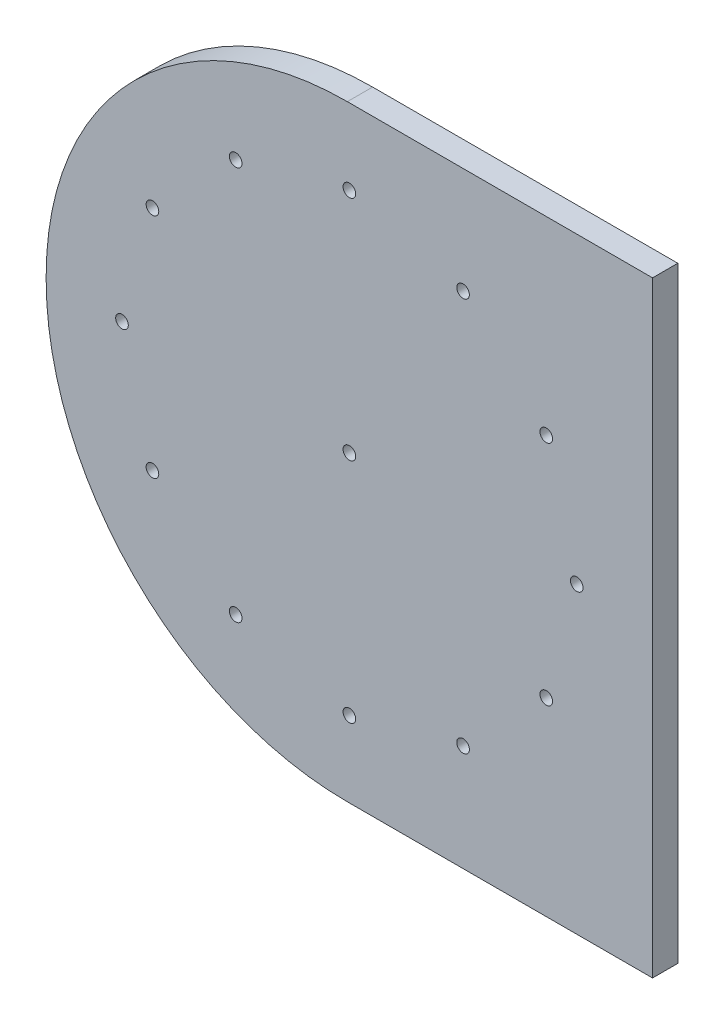
ISO-10303-21;
HEADER;
FILE_DESCRIPTION(('STEP AP214'),'2;1');
FILE_NAME('part.step','',(''),(''),'','','');
FILE_SCHEMA(('AUTOMOTIVE_DESIGN { 1 0 10303 214 1 1 1 1 }'));
ENDSEC;
DATA;
#1=APPLICATION_CONTEXT('core data for automotive mechanical design processes');
#2=APPLICATION_PROTOCOL_DEFINITION('international standard','automotive_design',2000,#1);
#3=PRODUCT_CONTEXT('',#1,'mechanical');
#4=PRODUCT('Part','Part','',(#3));
#5=PRODUCT_RELATED_PRODUCT_CATEGORY('part','',(#4));
#6=PRODUCT_DEFINITION_FORMATION('','',#4);
#7=PRODUCT_DEFINITION_CONTEXT('part definition',#1,'design');
#8=PRODUCT_DEFINITION('design','',#6,#7);
#9=PRODUCT_DEFINITION_SHAPE('','',#8);
#10=(LENGTH_UNIT() NAMED_UNIT(*) SI_UNIT(.MILLI.,.METRE.));
#11=(NAMED_UNIT(*) PLANE_ANGLE_UNIT() SI_UNIT($,.RADIAN.));
#12=(NAMED_UNIT(*) SI_UNIT($,.STERADIAN.) SOLID_ANGLE_UNIT());
#13=UNCERTAINTY_MEASURE_WITH_UNIT(LENGTH_MEASURE(1.E-05),#10,'distance_accuracy_value','');
#14=(GEOMETRIC_REPRESENTATION_CONTEXT(3) GLOBAL_UNCERTAINTY_ASSIGNED_CONTEXT((#13)) GLOBAL_UNIT_ASSIGNED_CONTEXT((#10,
#11,#12)) REPRESENTATION_CONTEXT('',''));
#15=CARTESIAN_POINT('',(0.,0.,0.));
#16=DIRECTION('',(0.,0.,1.));
#17=DIRECTION('',(1.,0.,0.));
#18=AXIS2_PLACEMENT_3D('',#15,#16,#17);
#19=CARTESIAN_POINT('',(37.846,-38.354,3.175));
#20=DIRECTION('',(0.,0.,1.));
#21=DIRECTION('',(1.,0.,0.));
#22=AXIS2_PLACEMENT_3D('',#19,#20,#21);
#23=PLANE('',#22);
#24=CARTESIAN_POINT('',(52.3875000000003,-13.3533240868598,3.175));
#25=DIRECTION('',(0.,0.,1.));
#26=DIRECTION('',(1.,0.,0.));
#27=AXIS2_PLACEMENT_3D('',#24,#25,#26);
#28=CIRCLE('',#27,0.793749999999998);
#29=CARTESIAN_POINT('',(53.1812500000003,-13.3533240868598,3.175));
#30=VERTEX_POINT('',#29);
#31=EDGE_CURVE('E228',#30,#30,#28,.F.);
#32=ORIENTED_EDGE('',*,*,#31,.T.);
#33=EDGE_LOOP('',(#32));
#34=FACE_BOUND('',#33,.T.);
#35=CARTESIAN_POINT('',(23.8125000000002,-13.3533240868595,3.175));
#36=DIRECTION('',(0.,0.,1.));
#37=DIRECTION('',(1.,0.,0.));
#38=AXIS2_PLACEMENT_3D('',#35,#36,#37);
#39=CIRCLE('',#38,0.793749999999999);
#40=CARTESIAN_POINT('',(24.6062500000002,-13.3533240868595,3.175));
#41=VERTEX_POINT('',#40);
#42=EDGE_CURVE('E239',#41,#41,#39,.F.);
#43=ORIENTED_EDGE('',*,*,#42,.T.);
#44=EDGE_LOOP('',(#43));
#45=FACE_BOUND('',#44,.T.);
#46=CARTESIAN_POINT('',(9.52500000000002,-38.0999999999994,3.175));
#47=DIRECTION('',(0.,0.,1.));
#48=DIRECTION('',(1.,0.,0.));
#49=AXIS2_PLACEMENT_3D('',#46,#47,#48);
#50=CIRCLE('',#49,0.79375);
#51=CARTESIAN_POINT('',(10.31875,-38.0999999999994,3.175));
#52=VERTEX_POINT('',#51);
#53=EDGE_CURVE('E251',#52,#52,#50,.F.);
#54=ORIENTED_EDGE('',*,*,#53,.T.);
#55=EDGE_LOOP('',(#54));
#56=FACE_BOUND('',#55,.T.);
#57=CARTESIAN_POINT('',(23.8124999999995,-62.8466759131401,3.175));
#58=DIRECTION('',(0.,0.,1.));
#59=DIRECTION('',(1.,0.,0.));
#60=AXIS2_PLACEMENT_3D('',#57,#58,#59);
#61=CIRCLE('',#60,0.793750000000006);
#62=CARTESIAN_POINT('',(24.6062499999995,-62.8466759131401,3.175));
#63=VERTEX_POINT('',#62);
#64=EDGE_CURVE('E263',#63,#63,#61,.F.);
#65=ORIENTED_EDGE('',*,*,#64,.T.);
#66=EDGE_LOOP('',(#65));
#67=FACE_BOUND('',#66,.T.);
#68=CARTESIAN_POINT('',(52.3874999999996,-62.8466759131406,3.175));
#69=DIRECTION('',(0.,0.,1.));
#70=DIRECTION('',(1.,0.,0.));
#71=AXIS2_PLACEMENT_3D('',#68,#69,#70);
#72=CIRCLE('',#71,0.793749999999992);
#73=CARTESIAN_POINT('',(53.1812499999996,-62.8466759131406,3.175));
#74=VERTEX_POINT('',#73);
#75=EDGE_CURVE('E275',#74,#74,#72,.F.);
#76=ORIENTED_EDGE('',*,*,#75,.T.);
#77=EDGE_LOOP('',(#76));
#78=FACE_BOUND('',#77,.T.);
#79=CARTESIAN_POINT('',(66.675,-38.1,3.175));
#80=DIRECTION('',(0.,0.,1.));
#81=DIRECTION('',(1.,0.,0.));
#82=AXIS2_PLACEMENT_3D('',#79,#80,#81);
#83=CIRCLE('',#82,0.793749999999993);
#84=CARTESIAN_POINT('',(67.46875,-38.1,3.175));
#85=VERTEX_POINT('',#84);
#86=EDGE_CURVE('E287',#85,#85,#83,.F.);
#87=ORIENTED_EDGE('',*,*,#86,.T.);
#88=EDGE_LOOP('',(#87));
#89=FACE_BOUND('',#88,.T.);
#90=CARTESIAN_POINT('',(37.846,-38.354,3.175));
#91=DIRECTION('',(0.,0.,1.));
#92=DIRECTION('',(1.,0.,0.));
#93=AXIS2_PLACEMENT_3D('',#90,#91,#92);
#94=CIRCLE('',#93,37.846);
#95=CARTESIAN_POINT('',(0.,-38.354,3.175));
#96=VERTEX_POINT('',#95);
#97=CARTESIAN_POINT('',(37.846,-76.2,3.175));
#98=VERTEX_POINT('',#97);
#99=EDGE_CURVE('E129',#96,#98,#94,.T.);
#100=ORIENTED_EDGE('',*,*,#99,.T.);
#101=DIRECTION('',(1.,0.,0.));
#102=VECTOR('',#101,1.);
#103=CARTESIAN_POINT('',(37.846,-76.2,3.175));
#104=LINE('',#103,#102);
#105=CARTESIAN_POINT('',(76.2,-76.2,3.175));
#106=VERTEX_POINT('',#105);
#107=EDGE_CURVE('E87',#98,#106,#104,.T.);
#108=ORIENTED_EDGE('',*,*,#107,.T.);
#109=DIRECTION('',(0.,1.,0.));
#110=VECTOR('',#109,1.);
#111=CARTESIAN_POINT('',(76.2,0.,3.175));
#112=LINE('',#111,#110);
#113=CARTESIAN_POINT('',(76.2,0.,3.175));
#114=VERTEX_POINT('',#113);
#115=EDGE_CURVE('E100',#106,#114,#112,.T.);
#116=ORIENTED_EDGE('',*,*,#115,.T.);
#117=DIRECTION('',(-1.,0.,0.));
#118=VECTOR('',#117,1.);
#119=CARTESIAN_POINT('',(37.846,0.,3.175));
#120=LINE('',#119,#118);
#121=CARTESIAN_POINT('',(37.846,0.,3.175));
#122=VERTEX_POINT('',#121);
#123=EDGE_CURVE('E94',#114,#122,#120,.T.);
#124=ORIENTED_EDGE('',*,*,#123,.T.);
#125=CARTESIAN_POINT('',(37.846,-37.846,3.175));
#126=DIRECTION('',(0.,0.,1.));
#127=DIRECTION('',(-1.,0.,0.));
#128=AXIS2_PLACEMENT_3D('',#125,#126,#127);
#129=CIRCLE('',#128,37.846);
#130=CARTESIAN_POINT('',(0.,-37.846,3.175));
#131=VERTEX_POINT('',#130);
#132=EDGE_CURVE('E98',#122,#131,#129,.T.);
#133=ORIENTED_EDGE('',*,*,#132,.T.);
#134=DIRECTION('',(0.,-1.,0.));
#135=VECTOR('',#134,1.);
#136=CARTESIAN_POINT('',(0.,-37.846,3.175));
#137=LINE('',#136,#135);
#138=EDGE_CURVE('E50',#131,#96,#137,.T.);
#139=ORIENTED_EDGE('',*,*,#138,.T.);
#140=EDGE_LOOP('',(#100,#108,#116,#124,#133,#139));
#141=FACE_BOUND('',#140,.T.);
#142=CARTESIAN_POINT('',(38.1,-38.1,3.175));
#143=DIRECTION('',(0.,0.,1.));
#144=DIRECTION('',(1.,0.,0.));
#145=AXIS2_PLACEMENT_3D('',#142,#143,#144);
#146=CIRCLE('',#145,0.793749999999999);
#147=CARTESIAN_POINT('',(38.89375,-38.1,3.175));
#148=VERTEX_POINT('',#147);
#149=EDGE_CURVE('E122',#148,#148,#146,.F.);
#150=ORIENTED_EDGE('',*,*,#149,.T.);
#151=EDGE_LOOP('',(#150));
#152=FACE_BOUND('',#151,.T.);
#153=CARTESIAN_POINT('',(62.8466759131401,-52.3875000000004,3.175));
#154=DIRECTION('',(0.,0.,1.));
#155=DIRECTION('',(1.,0.,0.));
#156=AXIS2_PLACEMENT_3D('',#153,#154,#155);
#157=CIRCLE('',#156,0.793749999999985);
#158=CARTESIAN_POINT('',(63.6404259131401,-52.3875000000004,3.175));
#159=VERTEX_POINT('',#158);
#160=EDGE_CURVE('E281',#159,#159,#157,.F.);
#161=ORIENTED_EDGE('',*,*,#160,.T.);
#162=EDGE_LOOP('',(#161));
#163=FACE_BOUND('',#162,.T.);
#164=CARTESIAN_POINT('',(38.0999999999995,-66.675,3.175));
#165=DIRECTION('',(0.,0.,1.));
#166=DIRECTION('',(1.,0.,0.));
#167=AXIS2_PLACEMENT_3D('',#164,#165,#166);
#168=CIRCLE('',#167,0.793750000000002);
#169=CARTESIAN_POINT('',(38.8937499999995,-66.675,3.175));
#170=VERTEX_POINT('',#169);
#171=EDGE_CURVE('E269',#170,#170,#168,.F.);
#172=ORIENTED_EDGE('',*,*,#171,.T.);
#173=EDGE_LOOP('',(#172));
#174=FACE_BOUND('',#173,.T.);
#175=CARTESIAN_POINT('',(13.3533240868594,-52.3874999999995,3.175));
#176=DIRECTION('',(0.,0.,1.));
#177=DIRECTION('',(1.,0.,0.));
#178=AXIS2_PLACEMENT_3D('',#175,#176,#177);
#179=CIRCLE('',#178,0.79375);
#180=CARTESIAN_POINT('',(14.1470740868594,-52.3874999999995,3.175));
#181=VERTEX_POINT('',#180);
#182=EDGE_CURVE('E257',#181,#181,#179,.F.);
#183=ORIENTED_EDGE('',*,*,#182,.T.);
#184=EDGE_LOOP('',(#183));
#185=FACE_BOUND('',#184,.T.);
#186=CARTESIAN_POINT('',(13.35332408686,-23.8124999999995,3.175));
#187=DIRECTION('',(0.,0.,1.));
#188=DIRECTION('',(1.,0.,0.));
#189=AXIS2_PLACEMENT_3D('',#186,#187,#188);
#190=CIRCLE('',#189,0.793750000000001);
#191=CARTESIAN_POINT('',(14.14707408686,-23.8124999999995,3.175));
#192=VERTEX_POINT('',#191);
#193=EDGE_CURVE('E245',#192,#192,#190,.F.);
#194=ORIENTED_EDGE('',*,*,#193,.T.);
#195=EDGE_LOOP('',(#194));
#196=FACE_BOUND('',#195,.T.);
#197=CARTESIAN_POINT('',(38.1000000000003,-9.52500000000001,3.175));
#198=DIRECTION('',(0.,0.,1.));
#199=DIRECTION('',(1.,0.,0.));
#200=AXIS2_PLACEMENT_3D('',#197,#198,#199);
#201=CIRCLE('',#200,0.793749999999999);
#202=CARTESIAN_POINT('',(38.8937500000003,-9.52500000000001,3.175));
#203=VERTEX_POINT('',#202);
#204=EDGE_CURVE('E233',#203,#203,#201,.F.);
#205=ORIENTED_EDGE('',*,*,#204,.T.);
#206=EDGE_LOOP('',(#205));
#207=FACE_BOUND('',#206,.T.);
#208=CARTESIAN_POINT('',(62.8466759131405,-23.8125000000004,3.175));
#209=DIRECTION('',(0.,0.,1.));
#210=DIRECTION('',(1.,0.,0.));
#211=AXIS2_PLACEMENT_3D('',#208,#209,#210);
#212=CIRCLE('',#211,0.793749999999993);
#213=CARTESIAN_POINT('',(63.6404259131405,-23.8125000000004,3.175));
#214=VERTEX_POINT('',#213);
#215=EDGE_CURVE('E217',#214,#214,#212,.F.);
#216=ORIENTED_EDGE('',*,*,#215,.T.);
#217=EDGE_LOOP('',(#216));
#218=FACE_BOUND('',#217,.T.);
#219=ADVANCED_FACE('F33',(#34,#45,#56,#67,#78,#89,#141,#152,#163,#174,#185,#196,#207,#218),#23,.T.);
#220=CARTESIAN_POINT('',(37.846,-38.354,0.));
#221=DIRECTION('',(0.,0.,1.));
#222=DIRECTION('',(1.,0.,0.));
#223=AXIS2_PLACEMENT_3D('',#220,#221,#222);
#224=PLANE('',#223);
#225=CARTESIAN_POINT('',(52.3875000000003,-13.3533240868598,0.));
#226=DIRECTION('',(0.,0.,1.));
#227=DIRECTION('',(1.,0.,0.));
#228=AXIS2_PLACEMENT_3D('',#225,#226,#227);
#229=CIRCLE('',#228,0.793749999999998);
#230=CARTESIAN_POINT('',(53.1812500000003,-13.3533240868598,0.));
#231=VERTEX_POINT('',#230);
#232=EDGE_CURVE('E223',#231,#231,#229,.T.);
#233=ORIENTED_EDGE('',*,*,#232,.T.);
#234=EDGE_LOOP('',(#233));
#235=FACE_BOUND('',#234,.T.);
#236=CARTESIAN_POINT('',(23.8125000000002,-13.3533240868595,0.));
#237=DIRECTION('',(0.,0.,1.));
#238=DIRECTION('',(1.,0.,0.));
#239=AXIS2_PLACEMENT_3D('',#236,#237,#238);
#240=CIRCLE('',#239,0.793749999999999);
#241=CARTESIAN_POINT('',(24.6062500000002,-13.3533240868595,0.));
#242=VERTEX_POINT('',#241);
#243=EDGE_CURVE('E236',#242,#242,#240,.T.);
#244=ORIENTED_EDGE('',*,*,#243,.T.);
#245=EDGE_LOOP('',(#244));
#246=FACE_BOUND('',#245,.T.);
#247=CARTESIAN_POINT('',(9.52500000000002,-38.0999999999994,0.));
#248=DIRECTION('',(0.,0.,1.));
#249=DIRECTION('',(1.,0.,0.));
#250=AXIS2_PLACEMENT_3D('',#247,#248,#249);
#251=CIRCLE('',#250,0.79375);
#252=CARTESIAN_POINT('',(10.31875,-38.0999999999994,0.));
#253=VERTEX_POINT('',#252);
#254=EDGE_CURVE('E248',#253,#253,#251,.T.);
#255=ORIENTED_EDGE('',*,*,#254,.T.);
#256=EDGE_LOOP('',(#255));
#257=FACE_BOUND('',#256,.T.);
#258=CARTESIAN_POINT('',(23.8124999999995,-62.8466759131401,0.));
#259=DIRECTION('',(0.,0.,1.));
#260=DIRECTION('',(1.,0.,0.));
#261=AXIS2_PLACEMENT_3D('',#258,#259,#260);
#262=CIRCLE('',#261,0.793750000000006);
#263=CARTESIAN_POINT('',(24.6062499999995,-62.8466759131401,0.));
#264=VERTEX_POINT('',#263);
#265=EDGE_CURVE('E260',#264,#264,#262,.T.);
#266=ORIENTED_EDGE('',*,*,#265,.T.);
#267=EDGE_LOOP('',(#266));
#268=FACE_BOUND('',#267,.T.);
#269=CARTESIAN_POINT('',(52.3874999999996,-62.8466759131406,0.));
#270=DIRECTION('',(0.,0.,1.));
#271=DIRECTION('',(1.,0.,0.));
#272=AXIS2_PLACEMENT_3D('',#269,#270,#271);
#273=CIRCLE('',#272,0.793749999999992);
#274=CARTESIAN_POINT('',(53.1812499999996,-62.8466759131406,0.));
#275=VERTEX_POINT('',#274);
#276=EDGE_CURVE('E272',#275,#275,#273,.T.);
#277=ORIENTED_EDGE('',*,*,#276,.T.);
#278=EDGE_LOOP('',(#277));
#279=FACE_BOUND('',#278,.T.);
#280=CARTESIAN_POINT('',(66.675,-38.1,0.));
#281=DIRECTION('',(0.,0.,1.));
#282=DIRECTION('',(1.,0.,0.));
#283=AXIS2_PLACEMENT_3D('',#280,#281,#282);
#284=CIRCLE('',#283,0.793749999999993);
#285=CARTESIAN_POINT('',(67.46875,-38.1,0.));
#286=VERTEX_POINT('',#285);
#287=EDGE_CURVE('E284',#286,#286,#284,.T.);
#288=ORIENTED_EDGE('',*,*,#287,.T.);
#289=EDGE_LOOP('',(#288));
#290=FACE_BOUND('',#289,.T.);
#291=CARTESIAN_POINT('',(37.846,-38.354,0.));
#292=DIRECTION('',(0.,0.,1.));
#293=DIRECTION('',(1.,0.,0.));
#294=AXIS2_PLACEMENT_3D('',#291,#292,#293);
#295=CIRCLE('',#294,37.846);
#296=CARTESIAN_POINT('',(0.,-38.354,0.));
#297=VERTEX_POINT('',#296);
#298=CARTESIAN_POINT('',(37.846,-76.2,0.));
#299=VERTEX_POINT('',#298);
#300=EDGE_CURVE('E118',#297,#299,#295,.T.);
#301=ORIENTED_EDGE('',*,*,#300,.F.);
#302=DIRECTION('',(0.,-1.,0.));
#303=VECTOR('',#302,1.);
#304=CARTESIAN_POINT('',(0.,-37.846,0.));
#305=LINE('',#304,#303);
#306=CARTESIAN_POINT('',(0.,-37.846,0.));
#307=VERTEX_POINT('',#306);
#308=EDGE_CURVE('E79',#307,#297,#305,.T.);
#309=ORIENTED_EDGE('',*,*,#308,.F.);
#310=CARTESIAN_POINT('',(37.846,-37.846,0.));
#311=DIRECTION('',(0.,0.,1.));
#312=DIRECTION('',(-1.,0.,0.));
#313=AXIS2_PLACEMENT_3D('',#310,#311,#312);
#314=CIRCLE('',#313,37.846);
#315=CARTESIAN_POINT('',(37.846,0.,0.));
#316=VERTEX_POINT('',#315);
#317=EDGE_CURVE('E73',#316,#307,#314,.T.);
#318=ORIENTED_EDGE('',*,*,#317,.F.);
#319=DIRECTION('',(-1.,0.,0.));
#320=VECTOR('',#319,1.);
#321=CARTESIAN_POINT('',(37.846,0.,0.));
#322=LINE('',#321,#320);
#323=CARTESIAN_POINT('',(76.2,0.,0.));
#324=VERTEX_POINT('',#323);
#325=EDGE_CURVE('E108',#324,#316,#322,.T.);
#326=ORIENTED_EDGE('',*,*,#325,.F.);
#327=DIRECTION('',(0.,1.,0.));
#328=VECTOR('',#327,1.);
#329=CARTESIAN_POINT('',(76.2,0.,0.));
#330=LINE('',#329,#328);
#331=CARTESIAN_POINT('',(76.2,-76.2,0.));
#332=VERTEX_POINT('',#331);
#333=EDGE_CURVE('E124',#332,#324,#330,.T.);
#334=ORIENTED_EDGE('',*,*,#333,.F.);
#335=DIRECTION('',(1.,0.,0.));
#336=VECTOR('',#335,1.);
#337=CARTESIAN_POINT('',(37.846,-76.2,0.));
#338=LINE('',#337,#336);
#339=EDGE_CURVE('E121',#299,#332,#338,.T.);
#340=ORIENTED_EDGE('',*,*,#339,.F.);
#341=EDGE_LOOP('',(#301,#309,#318,#326,#334,#340));
#342=FACE_BOUND('',#341,.T.);
#343=CARTESIAN_POINT('',(38.1,-38.1,0.));
#344=DIRECTION('',(0.,0.,1.));
#345=DIRECTION('',(1.,0.,0.));
#346=AXIS2_PLACEMENT_3D('',#343,#344,#345);
#347=CIRCLE('',#346,0.793749999999999);
#348=CARTESIAN_POINT('',(38.89375,-38.1,0.));
#349=VERTEX_POINT('',#348);
#350=EDGE_CURVE('E290',#349,#349,#347,.T.);
#351=ORIENTED_EDGE('',*,*,#350,.T.);
#352=EDGE_LOOP('',(#351));
#353=FACE_BOUND('',#352,.T.);
#354=CARTESIAN_POINT('',(62.8466759131401,-52.3875000000004,0.));
#355=DIRECTION('',(0.,0.,1.));
#356=DIRECTION('',(1.,0.,0.));
#357=AXIS2_PLACEMENT_3D('',#354,#355,#356);
#358=CIRCLE('',#357,0.793749999999985);
#359=CARTESIAN_POINT('',(63.6404259131401,-52.3875000000004,0.));
#360=VERTEX_POINT('',#359);
#361=EDGE_CURVE('E278',#360,#360,#358,.T.);
#362=ORIENTED_EDGE('',*,*,#361,.T.);
#363=EDGE_LOOP('',(#362));
#364=FACE_BOUND('',#363,.T.);
#365=CARTESIAN_POINT('',(38.0999999999995,-66.675,0.));
#366=DIRECTION('',(0.,0.,1.));
#367=DIRECTION('',(1.,0.,0.));
#368=AXIS2_PLACEMENT_3D('',#365,#366,#367);
#369=CIRCLE('',#368,0.793750000000002);
#370=CARTESIAN_POINT('',(38.8937499999995,-66.675,0.));
#371=VERTEX_POINT('',#370);
#372=EDGE_CURVE('E266',#371,#371,#369,.T.);
#373=ORIENTED_EDGE('',*,*,#372,.T.);
#374=EDGE_LOOP('',(#373));
#375=FACE_BOUND('',#374,.T.);
#376=CARTESIAN_POINT('',(13.3533240868594,-52.3874999999995,0.));
#377=DIRECTION('',(0.,0.,1.));
#378=DIRECTION('',(1.,0.,0.));
#379=AXIS2_PLACEMENT_3D('',#376,#377,#378);
#380=CIRCLE('',#379,0.79375);
#381=CARTESIAN_POINT('',(14.1470740868594,-52.3874999999995,0.));
#382=VERTEX_POINT('',#381);
#383=EDGE_CURVE('E254',#382,#382,#380,.T.);
#384=ORIENTED_EDGE('',*,*,#383,.T.);
#385=EDGE_LOOP('',(#384));
#386=FACE_BOUND('',#385,.T.);
#387=CARTESIAN_POINT('',(13.35332408686,-23.8124999999995,0.));
#388=DIRECTION('',(0.,0.,1.));
#389=DIRECTION('',(1.,0.,0.));
#390=AXIS2_PLACEMENT_3D('',#387,#388,#389);
#391=CIRCLE('',#390,0.793750000000001);
#392=CARTESIAN_POINT('',(14.14707408686,-23.8124999999995,0.));
#393=VERTEX_POINT('',#392);
#394=EDGE_CURVE('E242',#393,#393,#391,.T.);
#395=ORIENTED_EDGE('',*,*,#394,.T.);
#396=EDGE_LOOP('',(#395));
#397=FACE_BOUND('',#396,.T.);
#398=CARTESIAN_POINT('',(38.1000000000003,-9.52500000000001,0.));
#399=DIRECTION('',(0.,0.,1.));
#400=DIRECTION('',(1.,0.,0.));
#401=AXIS2_PLACEMENT_3D('',#398,#399,#400);
#402=CIRCLE('',#401,0.793749999999999);
#403=CARTESIAN_POINT('',(38.8937500000003,-9.52500000000001,0.));
#404=VERTEX_POINT('',#403);
#405=EDGE_CURVE('E230',#404,#404,#402,.T.);
#406=ORIENTED_EDGE('',*,*,#405,.T.);
#407=EDGE_LOOP('',(#406));
#408=FACE_BOUND('',#407,.T.);
#409=CARTESIAN_POINT('',(62.8466759131405,-23.8125000000004,0.));
#410=DIRECTION('',(0.,0.,1.));
#411=DIRECTION('',(1.,0.,0.));
#412=AXIS2_PLACEMENT_3D('',#409,#410,#411);
#413=CIRCLE('',#412,0.793749999999993);
#414=CARTESIAN_POINT('',(63.6404259131405,-23.8125000000004,0.));
#415=VERTEX_POINT('',#414);
#416=EDGE_CURVE('E220',#415,#415,#413,.T.);
#417=ORIENTED_EDGE('',*,*,#416,.T.);
#418=EDGE_LOOP('',(#417));
#419=FACE_BOUND('',#418,.T.);
#420=ADVANCED_FACE('F138',(#235,#246,#257,#268,#279,#290,#342,#353,#364,#375,#386,#397,#408,
#419),#224,.F.);
#421=CARTESIAN_POINT('',(37.846,-38.354,3.175));
#422=DIRECTION('',(0.,0.,-1.));
#423=DIRECTION('',(-1.,0.,0.));
#424=AXIS2_PLACEMENT_3D('',#421,#422,#423);
#425=CYLINDRICAL_SURFACE('',#424,37.846);
#426=ORIENTED_EDGE('',*,*,#300,.T.);
#427=DIRECTION('',(0.,0.,-1.));
#428=VECTOR('',#427,1.);
#429=CARTESIAN_POINT('',(37.846,-76.2,3.175));
#430=LINE('',#429,#428);
#431=EDGE_CURVE('E11',#98,#299,#430,.T.);
#432=ORIENTED_EDGE('',*,*,#431,.F.);
#433=ORIENTED_EDGE('',*,*,#99,.F.);
#434=DIRECTION('',(0.,0.,-1.));
#435=VECTOR('',#434,1.);
#436=CARTESIAN_POINT('',(0.,-38.354,3.175));
#437=LINE('',#436,#435);
#438=EDGE_CURVE('E114',#96,#297,#437,.T.);
#439=ORIENTED_EDGE('',*,*,#438,.T.);
#440=EDGE_LOOP('',(#426,#432,#433,#439));
#441=FACE_BOUND('',#440,.T.);
#442=ADVANCED_FACE('F35',(#441),#425,.T.);
#443=CARTESIAN_POINT('',(37.846,-76.2,3.175));
#444=DIRECTION('',(0.,1.,0.));
#445=DIRECTION('',(-1.,0.,0.));
#446=AXIS2_PLACEMENT_3D('',#443,#444,#445);
#447=PLANE('',#446);
#448=ORIENTED_EDGE('',*,*,#339,.T.);
#449=DIRECTION('',(0.,0.,-1.));
#450=VECTOR('',#449,1.);
#451=CARTESIAN_POINT('',(76.2,-76.2,3.175));
#452=LINE('',#451,#450);
#453=EDGE_CURVE('E42',#106,#332,#452,.T.);
#454=ORIENTED_EDGE('',*,*,#453,.F.);
#455=ORIENTED_EDGE('',*,*,#107,.F.);
#456=ORIENTED_EDGE('',*,*,#431,.T.);
#457=EDGE_LOOP('',(#448,#454,#455,#456));
#458=FACE_BOUND('',#457,.T.);
#459=ADVANCED_FACE('F438',(#458),#447,.F.);
#460=CARTESIAN_POINT('',(76.2,0.,3.175));
#461=DIRECTION('',(-1.,0.,0.));
#462=DIRECTION('',(0.,-1.,0.));
#463=AXIS2_PLACEMENT_3D('',#460,#461,#462);
#464=PLANE('',#463);
#465=ORIENTED_EDGE('',*,*,#333,.T.);
#466=DIRECTION('',(0.,0.,-1.));
#467=VECTOR('',#466,1.);
#468=CARTESIAN_POINT('',(76.2,0.,3.175));
#469=LINE('',#468,#467);
#470=EDGE_CURVE('E109',#114,#324,#469,.T.);
#471=ORIENTED_EDGE('',*,*,#470,.F.);
#472=ORIENTED_EDGE('',*,*,#115,.F.);
#473=ORIENTED_EDGE('',*,*,#453,.T.);
#474=EDGE_LOOP('',(#465,#471,#472,#473));
#475=FACE_BOUND('',#474,.T.);
#476=ADVANCED_FACE('F135',(#475),#464,.F.);
#477=CARTESIAN_POINT('',(37.846,0.,3.175));
#478=DIRECTION('',(0.,-1.,0.));
#479=DIRECTION('',(0.,0.,-1.));
#480=AXIS2_PLACEMENT_3D('',#477,#478,#479);
#481=PLANE('',#480);
#482=ORIENTED_EDGE('',*,*,#325,.T.);
#483=DIRECTION('',(0.,0.,-1.));
#484=VECTOR('',#483,1.);
#485=CARTESIAN_POINT('',(37.846,0.,3.175));
#486=LINE('',#485,#484);
#487=EDGE_CURVE('E105',#122,#316,#486,.T.);
#488=ORIENTED_EDGE('',*,*,#487,.F.);
#489=ORIENTED_EDGE('',*,*,#123,.F.);
#490=ORIENTED_EDGE('',*,*,#470,.T.);
#491=EDGE_LOOP('',(#482,#488,#489,#490));
#492=FACE_BOUND('',#491,.T.);
#493=ADVANCED_FACE('F106',(#492),#481,.F.);
#494=CARTESIAN_POINT('',(37.846,-37.846,3.175));
#495=DIRECTION('',(0.,0.,-1.));
#496=DIRECTION('',(-1.,0.,0.));
#497=AXIS2_PLACEMENT_3D('',#494,#495,#496);
#498=CYLINDRICAL_SURFACE('',#497,37.846);
#499=ORIENTED_EDGE('',*,*,#317,.T.);
#500=DIRECTION('',(0.,0.,-1.));
#501=VECTOR('',#500,1.);
#502=CARTESIAN_POINT('',(0.,-37.846,3.175));
#503=LINE('',#502,#501);
#504=EDGE_CURVE('E110',#131,#307,#503,.T.);
#505=ORIENTED_EDGE('',*,*,#504,.F.);
#506=ORIENTED_EDGE('',*,*,#132,.F.);
#507=ORIENTED_EDGE('',*,*,#487,.T.);
#508=EDGE_LOOP('',(#499,#505,#506,#507));
#509=FACE_BOUND('',#508,.T.);
#510=ADVANCED_FACE('F112',(#509),#498,.T.);
#511=CARTESIAN_POINT('',(0.,-37.846,3.175));
#512=DIRECTION('',(1.,0.,0.));
#513=DIRECTION('',(0.,0.,-1.));
#514=AXIS2_PLACEMENT_3D('',#511,#512,#513);
#515=PLANE('',#514);
#516=ORIENTED_EDGE('',*,*,#308,.T.);
#517=ORIENTED_EDGE('',*,*,#438,.F.);
#518=ORIENTED_EDGE('',*,*,#138,.F.);
#519=ORIENTED_EDGE('',*,*,#504,.T.);
#520=EDGE_LOOP('',(#516,#517,#518,#519));
#521=FACE_BOUND('',#520,.T.);
#522=ADVANCED_FACE('F143',(#521),#515,.F.);
#523=CARTESIAN_POINT('',(38.1,-38.1,19.05));
#524=DIRECTION('',(0.,0.,-1.));
#525=DIRECTION('',(-1.,0.,0.));
#526=AXIS2_PLACEMENT_3D('',#523,#524,#525);
#527=CYLINDRICAL_SURFACE('',#526,0.793749999999999);
#528=ORIENTED_EDGE('',*,*,#149,.F.);
#529=EDGE_LOOP('',(#528));
#530=FACE_BOUND('',#529,.T.);
#531=ORIENTED_EDGE('',*,*,#350,.F.);
#532=EDGE_LOOP('',(#531));
#533=FACE_BOUND('',#532,.T.);
#534=ADVANCED_FACE('F145',(#530,#533),#527,.F.);
#535=CARTESIAN_POINT('',(66.675,-38.1,19.05));
#536=DIRECTION('',(0.,0.,-1.));
#537=DIRECTION('',(-1.,0.,0.));
#538=AXIS2_PLACEMENT_3D('',#535,#536,#537);
#539=CYLINDRICAL_SURFACE('',#538,0.793749999999993);
#540=ORIENTED_EDGE('',*,*,#86,.F.);
#541=EDGE_LOOP('',(#540));
#542=FACE_BOUND('',#541,.T.);
#543=ORIENTED_EDGE('',*,*,#287,.F.);
#544=EDGE_LOOP('',(#543));
#545=FACE_BOUND('',#544,.T.);
#546=ADVANCED_FACE('F151',(#542,#545),#539,.F.);
#547=CARTESIAN_POINT('',(62.8466759131401,-52.3875000000004,19.05));
#548=DIRECTION('',(0.,0.,-1.));
#549=DIRECTION('',(-1.,0.,0.));
#550=AXIS2_PLACEMENT_3D('',#547,#548,#549);
#551=CYLINDRICAL_SURFACE('',#550,0.793749999999985);
#552=ORIENTED_EDGE('',*,*,#160,.F.);
#553=EDGE_LOOP('',(#552));
#554=FACE_BOUND('',#553,.T.);
#555=ORIENTED_EDGE('',*,*,#361,.F.);
#556=EDGE_LOOP('',(#555));
#557=FACE_BOUND('',#556,.T.);
#558=ADVANCED_FACE('F168',(#554,#557),#551,.F.);
#559=CARTESIAN_POINT('',(52.3874999999996,-62.8466759131406,19.05));
#560=DIRECTION('',(0.,0.,-1.));
#561=DIRECTION('',(-1.,0.,0.));
#562=AXIS2_PLACEMENT_3D('',#559,#560,#561);
#563=CYLINDRICAL_SURFACE('',#562,0.793749999999992);
#564=ORIENTED_EDGE('',*,*,#75,.F.);
#565=EDGE_LOOP('',(#564));
#566=FACE_BOUND('',#565,.T.);
#567=ORIENTED_EDGE('',*,*,#276,.F.);
#568=EDGE_LOOP('',(#567));
#569=FACE_BOUND('',#568,.T.);
#570=ADVANCED_FACE('F172',(#566,#569),#563,.F.);
#571=CARTESIAN_POINT('',(38.0999999999995,-66.675,19.05));
#572=DIRECTION('',(0.,0.,-1.));
#573=DIRECTION('',(-1.,0.,0.));
#574=AXIS2_PLACEMENT_3D('',#571,#572,#573);
#575=CYLINDRICAL_SURFACE('',#574,0.793750000000002);
#576=ORIENTED_EDGE('',*,*,#171,.F.);
#577=EDGE_LOOP('',(#576));
#578=FACE_BOUND('',#577,.T.);
#579=ORIENTED_EDGE('',*,*,#372,.F.);
#580=EDGE_LOOP('',(#579));
#581=FACE_BOUND('',#580,.T.);
#582=ADVANCED_FACE('F176',(#578,#581),#575,.F.);
#583=CARTESIAN_POINT('',(23.8124999999995,-62.8466759131401,19.05));
#584=DIRECTION('',(0.,0.,-1.));
#585=DIRECTION('',(-1.,0.,0.));
#586=AXIS2_PLACEMENT_3D('',#583,#584,#585);
#587=CYLINDRICAL_SURFACE('',#586,0.793750000000006);
#588=ORIENTED_EDGE('',*,*,#64,.F.);
#589=EDGE_LOOP('',(#588));
#590=FACE_BOUND('',#589,.T.);
#591=ORIENTED_EDGE('',*,*,#265,.F.);
#592=EDGE_LOOP('',(#591));
#593=FACE_BOUND('',#592,.T.);
#594=ADVANCED_FACE('F180',(#590,#593),#587,.F.);
#595=CARTESIAN_POINT('',(13.3533240868594,-52.3874999999995,19.05));
#596=DIRECTION('',(0.,0.,-1.));
#597=DIRECTION('',(-1.,0.,0.));
#598=AXIS2_PLACEMENT_3D('',#595,#596,#597);
#599=CYLINDRICAL_SURFACE('',#598,0.79375);
#600=ORIENTED_EDGE('',*,*,#182,.F.);
#601=EDGE_LOOP('',(#600));
#602=FACE_BOUND('',#601,.T.);
#603=ORIENTED_EDGE('',*,*,#383,.F.);
#604=EDGE_LOOP('',(#603));
#605=FACE_BOUND('',#604,.T.);
#606=ADVANCED_FACE('F184',(#602,#605),#599,.F.);
#607=CARTESIAN_POINT('',(9.52500000000002,-38.0999999999994,19.05));
#608=DIRECTION('',(0.,0.,-1.));
#609=DIRECTION('',(-1.,0.,0.));
#610=AXIS2_PLACEMENT_3D('',#607,#608,#609);
#611=CYLINDRICAL_SURFACE('',#610,0.79375);
#612=ORIENTED_EDGE('',*,*,#53,.F.);
#613=EDGE_LOOP('',(#612));
#614=FACE_BOUND('',#613,.T.);
#615=ORIENTED_EDGE('',*,*,#254,.F.);
#616=EDGE_LOOP('',(#615));
#617=FACE_BOUND('',#616,.T.);
#618=ADVANCED_FACE('F188',(#614,#617),#611,.F.);
#619=CARTESIAN_POINT('',(13.35332408686,-23.8124999999995,19.05));
#620=DIRECTION('',(0.,0.,-1.));
#621=DIRECTION('',(-1.,0.,0.));
#622=AXIS2_PLACEMENT_3D('',#619,#620,#621);
#623=CYLINDRICAL_SURFACE('',#622,0.793750000000001);
#624=ORIENTED_EDGE('',*,*,#193,.F.);
#625=EDGE_LOOP('',(#624));
#626=FACE_BOUND('',#625,.T.);
#627=ORIENTED_EDGE('',*,*,#394,.F.);
#628=EDGE_LOOP('',(#627));
#629=FACE_BOUND('',#628,.T.);
#630=ADVANCED_FACE('F192',(#626,#629),#623,.F.);
#631=CARTESIAN_POINT('',(23.8125000000002,-13.3533240868595,19.05));
#632=DIRECTION('',(0.,0.,-1.));
#633=DIRECTION('',(-1.,0.,0.));
#634=AXIS2_PLACEMENT_3D('',#631,#632,#633);
#635=CYLINDRICAL_SURFACE('',#634,0.793749999999999);
#636=ORIENTED_EDGE('',*,*,#42,.F.);
#637=EDGE_LOOP('',(#636));
#638=FACE_BOUND('',#637,.T.);
#639=ORIENTED_EDGE('',*,*,#243,.F.);
#640=EDGE_LOOP('',(#639));
#641=FACE_BOUND('',#640,.T.);
#642=ADVANCED_FACE('F196',(#638,#641),#635,.F.);
#643=CARTESIAN_POINT('',(38.1000000000003,-9.52500000000001,19.05));
#644=DIRECTION('',(0.,0.,-1.));
#645=DIRECTION('',(-1.,0.,0.));
#646=AXIS2_PLACEMENT_3D('',#643,#644,#645);
#647=CYLINDRICAL_SURFACE('',#646,0.793749999999999);
#648=ORIENTED_EDGE('',*,*,#204,.F.);
#649=EDGE_LOOP('',(#648));
#650=FACE_BOUND('',#649,.T.);
#651=ORIENTED_EDGE('',*,*,#405,.F.);
#652=EDGE_LOOP('',(#651));
#653=FACE_BOUND('',#652,.T.);
#654=ADVANCED_FACE('F200',(#650,#653),#647,.F.);
#655=CARTESIAN_POINT('',(52.3875000000003,-13.3533240868598,19.05));
#656=DIRECTION('',(0.,0.,-1.));
#657=DIRECTION('',(-1.,0.,0.));
#658=AXIS2_PLACEMENT_3D('',#655,#656,#657);
#659=CYLINDRICAL_SURFACE('',#658,0.793749999999998);
#660=ORIENTED_EDGE('',*,*,#31,.F.);
#661=EDGE_LOOP('',(#660));
#662=FACE_BOUND('',#661,.T.);
#663=ORIENTED_EDGE('',*,*,#232,.F.);
#664=EDGE_LOOP('',(#663));
#665=FACE_BOUND('',#664,.T.);
#666=ADVANCED_FACE('F204',(#662,#665),#659,.F.);
#667=CARTESIAN_POINT('',(62.8466759131405,-23.8125000000004,19.05));
#668=DIRECTION('',(0.,0.,-1.));
#669=DIRECTION('',(-1.,0.,0.));
#670=AXIS2_PLACEMENT_3D('',#667,#668,#669);
#671=CYLINDRICAL_SURFACE('',#670,0.793749999999993);
#672=ORIENTED_EDGE('',*,*,#215,.F.);
#673=EDGE_LOOP('',(#672));
#674=FACE_BOUND('',#673,.T.);
#675=ORIENTED_EDGE('',*,*,#416,.F.);
#676=EDGE_LOOP('',(#675));
#677=FACE_BOUND('',#676,.T.);
#678=ADVANCED_FACE('F208',(#674,#677),#671,.F.);
#679=CLOSED_SHELL('',(#219,#420,#442,#459,#476,#493,#510,#522,#534,#546,#558,#570,#582,#594,
#606,#618,#630,#642,#654,#666,#678));
#680=MANIFOLD_SOLID_BREP('B2',#679);
#681=ADVANCED_BREP_SHAPE_REPRESENTATION('',(#18,#680),#14);
#682=SHAPE_DEFINITION_REPRESENTATION(#9,#681);
ENDSEC;
END-ISO-10303-21;
